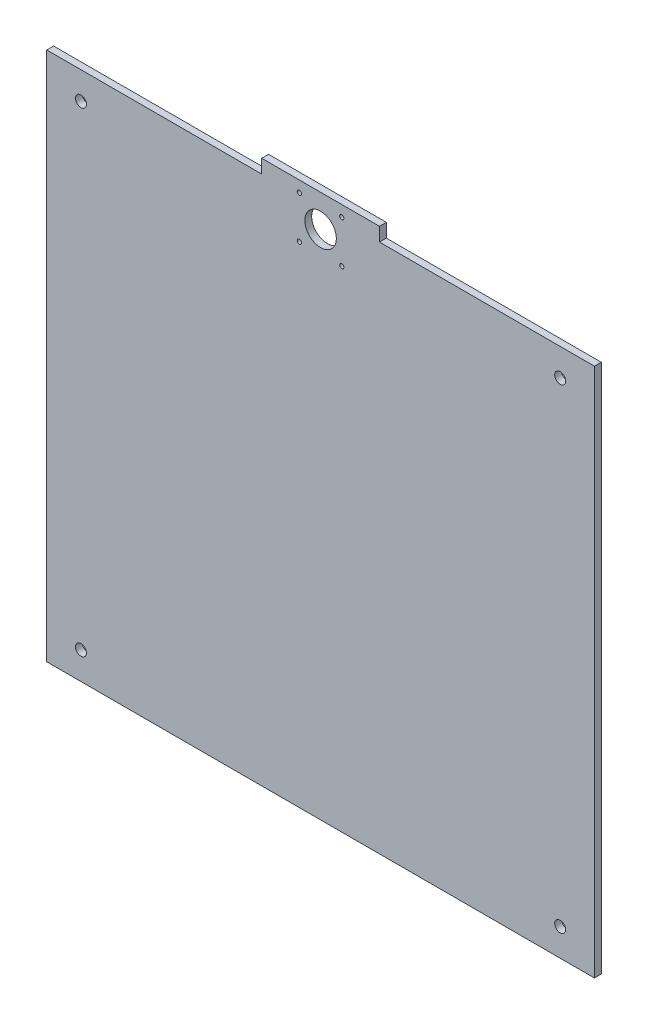
ISO-10303-21;
HEADER;
FILE_DESCRIPTION(('STEP AP214'),'2;1');
FILE_NAME('part.step','',(''),(''),'','','');
FILE_SCHEMA(('AUTOMOTIVE_DESIGN { 1 0 10303 214 1 1 1 1 }'));
ENDSEC;
DATA;
#1=APPLICATION_CONTEXT('core data for automotive mechanical design processes');
#2=APPLICATION_PROTOCOL_DEFINITION('international standard','automotive_design',2000,#1);
#3=PRODUCT_CONTEXT('',#1,'mechanical');
#4=PRODUCT('Part','Part','',(#3));
#5=PRODUCT_RELATED_PRODUCT_CATEGORY('part','',(#4));
#6=PRODUCT_DEFINITION_FORMATION('','',#4);
#7=PRODUCT_DEFINITION_CONTEXT('part definition',#1,'design');
#8=PRODUCT_DEFINITION('design','',#6,#7);
#9=PRODUCT_DEFINITION_SHAPE('','',#8);
#10=(LENGTH_UNIT() NAMED_UNIT(*) SI_UNIT(.MILLI.,.METRE.));
#11=(NAMED_UNIT(*) PLANE_ANGLE_UNIT() SI_UNIT($,.RADIAN.));
#12=(NAMED_UNIT(*) SI_UNIT($,.STERADIAN.) SOLID_ANGLE_UNIT());
#13=UNCERTAINTY_MEASURE_WITH_UNIT(LENGTH_MEASURE(1.E-05),#10,'distance_accuracy_value','');
#14=(GEOMETRIC_REPRESENTATION_CONTEXT(3) GLOBAL_UNCERTAINTY_ASSIGNED_CONTEXT((#13)) GLOBAL_UNIT_ASSIGNED_CONTEXT((#10,
#11,#12)) REPRESENTATION_CONTEXT('',''));
#15=CARTESIAN_POINT('',(0.,0.,0.));
#16=DIRECTION('',(0.,0.,1.));
#17=DIRECTION('',(1.,0.,0.));
#18=AXIS2_PLACEMENT_3D('',#15,#16,#17);
#19=CARTESIAN_POINT('',(0.,0.,5.));
#20=DIRECTION('',(1.,0.,0.));
#21=DIRECTION('',(0.,0.,-1.));
#22=AXIS2_PLACEMENT_3D('',#19,#20,#21);
#23=PLANE('',#22);
#24=DIRECTION('',(0.,-1.,0.));
#25=VECTOR('',#24,1.);
#26=CARTESIAN_POINT('',(0.,0.,5.));
#27=LINE('',#26,#25);
#28=CARTESIAN_POINT('',(0.,387.,5.));
#29=VERTEX_POINT('',#28);
#30=CARTESIAN_POINT('',(0.,0.,5.));
#31=VERTEX_POINT('',#30);
#32=EDGE_CURVE('E112',#29,#31,#27,.T.);
#33=ORIENTED_EDGE('',*,*,#32,.F.);
#34=DIRECTION('',(0.,0.,1.));
#35=VECTOR('',#34,1.);
#36=CARTESIAN_POINT('',(0.,387.,0.));
#37=LINE('',#36,#35);
#38=CARTESIAN_POINT('',(0.,387.,0.));
#39=VERTEX_POINT('',#38);
#40=EDGE_CURVE('E100',#39,#29,#37,.T.);
#41=ORIENTED_EDGE('',*,*,#40,.F.);
#42=DIRECTION('',(0.,-1.,0.));
#43=VECTOR('',#42,1.);
#44=CARTESIAN_POINT('',(0.,0.,0.));
#45=LINE('',#44,#43);
#46=CARTESIAN_POINT('',(0.,0.,0.));
#47=VERTEX_POINT('',#46);
#48=EDGE_CURVE('E110',#39,#47,#45,.T.);
#49=ORIENTED_EDGE('',*,*,#48,.T.);
#50=DIRECTION('',(0.,0.,-1.));
#51=VECTOR('',#50,1.);
#52=CARTESIAN_POINT('',(0.,0.,5.));
#53=LINE('',#52,#51);
#54=EDGE_CURVE('E11',#31,#47,#53,.T.);
#55=ORIENTED_EDGE('',*,*,#54,.F.);
#56=EDGE_LOOP('',(#33,#41,#49,#55));
#57=FACE_BOUND('',#56,.T.);
#58=ADVANCED_FACE('F33',(#57),#23,.F.);
#59=CARTESIAN_POINT('',(0.,0.,5.));
#60=DIRECTION('',(0.,1.,0.));
#61=DIRECTION('',(0.,0.,1.));
#62=AXIS2_PLACEMENT_3D('',#59,#60,#61);
#63=PLANE('',#62);
#64=DIRECTION('',(1.,0.,0.));
#65=VECTOR('',#64,1.);
#66=CARTESIAN_POINT('',(0.,0.,0.));
#67=LINE('',#66,#65);
#68=CARTESIAN_POINT('',(400.,0.,0.));
#69=VERTEX_POINT('',#68);
#70=EDGE_CURVE('E117',#47,#69,#67,.T.);
#71=ORIENTED_EDGE('',*,*,#70,.T.);
#72=DIRECTION('',(0.,0.,-1.));
#73=VECTOR('',#72,1.);
#74=CARTESIAN_POINT('',(400.,0.,5.));
#75=LINE('',#74,#73);
#76=CARTESIAN_POINT('',(400.,0.,5.));
#77=VERTEX_POINT('',#76);
#78=EDGE_CURVE('E40',#77,#69,#75,.T.);
#79=ORIENTED_EDGE('',*,*,#78,.F.);
#80=DIRECTION('',(1.,0.,0.));
#81=VECTOR('',#80,1.);
#82=CARTESIAN_POINT('',(0.,0.,5.));
#83=LINE('',#82,#81);
#84=EDGE_CURVE('E144',#31,#77,#83,.T.);
#85=ORIENTED_EDGE('',*,*,#84,.F.);
#86=ORIENTED_EDGE('',*,*,#54,.T.);
#87=EDGE_LOOP('',(#71,#79,#85,#86));
#88=FACE_BOUND('',#87,.T.);
#89=ADVANCED_FACE('F264',(#88),#63,.F.);
#90=CARTESIAN_POINT('',(400.,0.,5.));
#91=DIRECTION('',(-1.,0.,0.));
#92=DIRECTION('',(0.,0.,1.));
#93=AXIS2_PLACEMENT_3D('',#90,#91,#92);
#94=PLANE('',#93);
#95=DIRECTION('',(0.,1.,0.));
#96=VECTOR('',#95,1.);
#97=CARTESIAN_POINT('',(400.,0.,0.));
#98=LINE('',#97,#96);
#99=CARTESIAN_POINT('',(400.,387.,0.));
#100=VERTEX_POINT('',#99);
#101=EDGE_CURVE('E120',#69,#100,#98,.T.);
#102=ORIENTED_EDGE('',*,*,#101,.T.);
#103=DIRECTION('',(0.,0.,1.));
#104=VECTOR('',#103,1.);
#105=CARTESIAN_POINT('',(400.,387.,0.));
#106=LINE('',#105,#104);
#107=CARTESIAN_POINT('',(400.,387.,5.));
#108=VERTEX_POINT('',#107);
#109=EDGE_CURVE('E173',#100,#108,#106,.T.);
#110=ORIENTED_EDGE('',*,*,#109,.T.);
#111=DIRECTION('',(0.,1.,0.));
#112=VECTOR('',#111,1.);
#113=CARTESIAN_POINT('',(400.,0.,5.));
#114=LINE('',#113,#112);
#115=EDGE_CURVE('E138',#77,#108,#114,.T.);
#116=ORIENTED_EDGE('',*,*,#115,.F.);
#117=ORIENTED_EDGE('',*,*,#78,.T.);
#118=EDGE_LOOP('',(#102,#110,#116,#117));
#119=FACE_BOUND('',#118,.T.);
#120=ADVANCED_FACE('F268',(#119),#94,.F.);
#121=CARTESIAN_POINT('',(0.,397.,5.));
#122=DIRECTION('',(0.,-1.,0.));
#123=DIRECTION('',(0.,0.,-1.));
#124=AXIS2_PLACEMENT_3D('',#121,#122,#123);
#125=PLANE('',#124);
#126=DIRECTION('',(-1.,0.,0.));
#127=VECTOR('',#126,1.);
#128=CARTESIAN_POINT('',(0.,397.,0.));
#129=LINE('',#128,#127);
#130=CARTESIAN_POINT('',(243.,397.,0.));
#131=VERTEX_POINT('',#130);
#132=CARTESIAN_POINT('',(157.,397.,0.));
#133=VERTEX_POINT('',#132);
#134=EDGE_CURVE('E131',#131,#133,#129,.T.);
#135=ORIENTED_EDGE('',*,*,#134,.T.);
#136=DIRECTION('',(0.,0.,1.));
#137=VECTOR('',#136,1.);
#138=CARTESIAN_POINT('',(157.,397.,0.));
#139=LINE('',#138,#137);
#140=CARTESIAN_POINT('',(157.,397.,5.));
#141=VERTEX_POINT('',#140);
#142=EDGE_CURVE('E188',#133,#141,#139,.T.);
#143=ORIENTED_EDGE('',*,*,#142,.T.);
#144=DIRECTION('',(-1.,0.,0.));
#145=VECTOR('',#144,1.);
#146=CARTESIAN_POINT('',(0.,397.,5.));
#147=LINE('',#146,#145);
#148=CARTESIAN_POINT('',(243.,397.,5.));
#149=VERTEX_POINT('',#148);
#150=EDGE_CURVE('E126',#149,#141,#147,.T.);
#151=ORIENTED_EDGE('',*,*,#150,.F.);
#152=DIRECTION('',(0.,0.,1.));
#153=VECTOR('',#152,1.);
#154=CARTESIAN_POINT('',(243.,397.,0.));
#155=LINE('',#154,#153);
#156=EDGE_CURVE('E176',#131,#149,#155,.T.);
#157=ORIENTED_EDGE('',*,*,#156,.F.);
#158=EDGE_LOOP('',(#135,#143,#151,#157));
#159=FACE_BOUND('',#158,.T.);
#160=ADVANCED_FACE('F230',(#159),#125,.F.);
#161=CARTESIAN_POINT('',(0.,0.,5.));
#162=DIRECTION('',(0.,0.,-1.));
#163=DIRECTION('',(-1.,0.,0.));
#164=AXIS2_PLACEMENT_3D('',#161,#162,#163);
#165=PLANE('',#164);
#166=CARTESIAN_POINT('',(375.000000000002,367.03,5.));
#167=DIRECTION('',(0.,0.,1.));
#168=DIRECTION('',(-1.,0.,0.));
#169=AXIS2_PLACEMENT_3D('',#166,#167,#168);
#170=CIRCLE('',#169,3.99999999999999);
#171=CARTESIAN_POINT('',(371.000000000002,367.03,5.));
#172=VERTEX_POINT('',#171);
#173=EDGE_CURVE('E220',#172,#172,#170,.T.);
#174=ORIENTED_EDGE('',*,*,#173,.F.);
#175=EDGE_LOOP('',(#174));
#176=FACE_BOUND('',#175,.T.);
#177=CARTESIAN_POINT('',(375.000000000002,20.03,5.));
#178=DIRECTION('',(0.,0.,1.));
#179=DIRECTION('',(1.,0.,0.));
#180=AXIS2_PLACEMENT_3D('',#177,#178,#179);
#181=CIRCLE('',#180,4.00000000000005);
#182=CARTESIAN_POINT('',(379.000000000002,20.03,5.));
#183=VERTEX_POINT('',#182);
#184=EDGE_CURVE('E214',#183,#183,#181,.T.);
#185=ORIENTED_EDGE('',*,*,#184,.F.);
#186=EDGE_LOOP('',(#185));
#187=FACE_BOUND('',#186,.T.);
#188=CARTESIAN_POINT('',(24.9999999999984,20.03,5.));
#189=DIRECTION('',(0.,0.,1.));
#190=DIRECTION('',(-1.,0.,0.));
#191=AXIS2_PLACEMENT_3D('',#188,#189,#190);
#192=CIRCLE('',#191,4.);
#193=CARTESIAN_POINT('',(20.9999999999984,20.03,5.));
#194=VERTEX_POINT('',#193);
#195=EDGE_CURVE('E208',#194,#194,#192,.T.);
#196=ORIENTED_EDGE('',*,*,#195,.F.);
#197=EDGE_LOOP('',(#196));
#198=FACE_BOUND('',#197,.T.);
#199=CARTESIAN_POINT('',(24.9999999999984,367.03,5.));
#200=DIRECTION('',(0.,0.,1.));
#201=DIRECTION('',(1.,0.,0.));
#202=AXIS2_PLACEMENT_3D('',#199,#200,#201);
#203=CIRCLE('',#202,4.);
#204=CARTESIAN_POINT('',(28.9999999999984,367.03,5.));
#205=VERTEX_POINT('',#204);
#206=EDGE_CURVE('E202',#205,#205,#203,.T.);
#207=ORIENTED_EDGE('',*,*,#206,.F.);
#208=EDGE_LOOP('',(#207));
#209=FACE_BOUND('',#208,.T.);
#210=CARTESIAN_POINT('',(200.,373.5,5.));
#211=DIRECTION('',(0.,0.,1.));
#212=DIRECTION('',(1.,0.,0.));
#213=AXIS2_PLACEMENT_3D('',#210,#211,#212);
#214=CIRCLE('',#213,11.5);
#215=CARTESIAN_POINT('',(211.5,373.5,5.));
#216=VERTEX_POINT('',#215);
#217=EDGE_CURVE('E170',#216,#216,#214,.T.);
#218=ORIENTED_EDGE('',*,*,#217,.F.);
#219=EDGE_LOOP('',(#218));
#220=FACE_BOUND('',#219,.T.);
#221=CARTESIAN_POINT('',(184.5,389.,5.));
#222=DIRECTION('',(0.,0.,1.));
#223=DIRECTION('',(-1.,0.,0.));
#224=AXIS2_PLACEMENT_3D('',#221,#222,#223);
#225=CIRCLE('',#224,1.55);
#226=CARTESIAN_POINT('',(182.95,389.,5.));
#227=VERTEX_POINT('',#226);
#228=EDGE_CURVE('E164',#227,#227,#225,.T.);
#229=ORIENTED_EDGE('',*,*,#228,.F.);
#230=EDGE_LOOP('',(#229));
#231=FACE_BOUND('',#230,.T.);
#232=CARTESIAN_POINT('',(184.5,358.,5.));
#233=DIRECTION('',(0.,0.,1.));
#234=DIRECTION('',(-1.,0.,0.));
#235=AXIS2_PLACEMENT_3D('',#232,#233,#234);
#236=CIRCLE('',#235,1.55);
#237=CARTESIAN_POINT('',(182.95,358.,5.));
#238=VERTEX_POINT('',#237);
#239=EDGE_CURVE('E158',#238,#238,#236,.T.);
#240=ORIENTED_EDGE('',*,*,#239,.F.);
#241=EDGE_LOOP('',(#240));
#242=FACE_BOUND('',#241,.T.);
#243=CARTESIAN_POINT('',(215.5,358.,5.));
#244=DIRECTION('',(0.,0.,1.));
#245=DIRECTION('',(1.,0.,0.));
#246=AXIS2_PLACEMENT_3D('',#243,#244,#245);
#247=CIRCLE('',#246,1.55);
#248=CARTESIAN_POINT('',(217.05,358.,5.));
#249=VERTEX_POINT('',#248);
#250=EDGE_CURVE('E152',#249,#249,#247,.T.);
#251=ORIENTED_EDGE('',*,*,#250,.F.);
#252=EDGE_LOOP('',(#251));
#253=FACE_BOUND('',#252,.T.);
#254=CARTESIAN_POINT('',(215.5,389.,5.));
#255=DIRECTION('',(0.,0.,1.));
#256=DIRECTION('',(1.,0.,0.));
#257=AXIS2_PLACEMENT_3D('',#254,#255,#256);
#258=CIRCLE('',#257,1.55);
#259=CARTESIAN_POINT('',(217.05,389.,5.));
#260=VERTEX_POINT('',#259);
#261=EDGE_CURVE('E123',#260,#260,#258,.T.);
#262=ORIENTED_EDGE('',*,*,#261,.F.);
#263=EDGE_LOOP('',(#262));
#264=FACE_BOUND('',#263,.T.);
#265=ORIENTED_EDGE('',*,*,#150,.T.);
#266=DIRECTION('',(0.,1.,0.));
#267=VECTOR('',#266,1.);
#268=CARTESIAN_POINT('',(157.,387.,5.));
#269=LINE('',#268,#267);
#270=CARTESIAN_POINT('',(157.,387.,5.));
#271=VERTEX_POINT('',#270);
#272=EDGE_CURVE('E105',#271,#141,#269,.T.);
#273=ORIENTED_EDGE('',*,*,#272,.F.);
#274=DIRECTION('',(1.,0.,0.));
#275=VECTOR('',#274,1.);
#276=CARTESIAN_POINT('',(0.,387.,5.));
#277=LINE('',#276,#275);
#278=EDGE_CURVE('E196',#29,#271,#277,.T.);
#279=ORIENTED_EDGE('',*,*,#278,.F.);
#280=ORIENTED_EDGE('',*,*,#32,.T.);
#281=ORIENTED_EDGE('',*,*,#84,.T.);
#282=ORIENTED_EDGE('',*,*,#115,.T.);
#283=DIRECTION('',(1.,0.,0.));
#284=VECTOR('',#283,1.);
#285=CARTESIAN_POINT('',(400.,387.,5.));
#286=LINE('',#285,#284);
#287=CARTESIAN_POINT('',(243.,387.,5.));
#288=VERTEX_POINT('',#287);
#289=EDGE_CURVE('E182',#288,#108,#286,.T.);
#290=ORIENTED_EDGE('',*,*,#289,.F.);
#291=DIRECTION('',(0.,-1.,0.));
#292=VECTOR('',#291,1.);
#293=CARTESIAN_POINT('',(243.,387.,5.));
#294=LINE('',#293,#292);
#295=EDGE_CURVE('E185',#149,#288,#294,.T.);
#296=ORIENTED_EDGE('',*,*,#295,.F.);
#297=EDGE_LOOP('',(#265,#273,#279,#280,#281,#282,#290,#296));
#298=FACE_BOUND('',#297,.T.);
#299=ADVANCED_FACE('F227',(#176,#187,#198,#209,#220,#231,#242,#253,#264,#298),#165,.F.);
#300=CARTESIAN_POINT('',(0.,0.,0.));
#301=DIRECTION('',(0.,0.,-1.));
#302=DIRECTION('',(-1.,0.,0.));
#303=AXIS2_PLACEMENT_3D('',#300,#301,#302);
#304=PLANE('',#303);
#305=CARTESIAN_POINT('',(375.000000000002,367.03,0.));
#306=DIRECTION('',(0.,0.,-1.));
#307=DIRECTION('',(-1.,0.,0.));
#308=AXIS2_PLACEMENT_3D('',#305,#306,#307);
#309=CIRCLE('',#308,3.99999999999999);
#310=CARTESIAN_POINT('',(371.000000000002,367.03,0.));
#311=VERTEX_POINT('',#310);
#312=EDGE_CURVE('E217',#311,#311,#309,.F.);
#313=ORIENTED_EDGE('',*,*,#312,.T.);
#314=EDGE_LOOP('',(#313));
#315=FACE_BOUND('',#314,.T.);
#316=CARTESIAN_POINT('',(375.000000000002,20.03,0.));
#317=DIRECTION('',(0.,0.,-1.));
#318=DIRECTION('',(-1.,0.,0.));
#319=AXIS2_PLACEMENT_3D('',#316,#317,#318);
#320=CIRCLE('',#319,4.00000000000005);
#321=CARTESIAN_POINT('',(371.000000000002,20.03,0.));
#322=VERTEX_POINT('',#321);
#323=EDGE_CURVE('E211',#322,#322,#320,.F.);
#324=ORIENTED_EDGE('',*,*,#323,.T.);
#325=EDGE_LOOP('',(#324));
#326=FACE_BOUND('',#325,.T.);
#327=CARTESIAN_POINT('',(24.9999999999984,20.03,0.));
#328=DIRECTION('',(0.,0.,-1.));
#329=DIRECTION('',(-1.,0.,0.));
#330=AXIS2_PLACEMENT_3D('',#327,#328,#329);
#331=CIRCLE('',#330,4.);
#332=CARTESIAN_POINT('',(20.9999999999984,20.03,0.));
#333=VERTEX_POINT('',#332);
#334=EDGE_CURVE('E205',#333,#333,#331,.F.);
#335=ORIENTED_EDGE('',*,*,#334,.T.);
#336=EDGE_LOOP('',(#335));
#337=FACE_BOUND('',#336,.T.);
#338=CARTESIAN_POINT('',(24.9999999999984,367.03,0.));
#339=DIRECTION('',(0.,0.,-1.));
#340=DIRECTION('',(-1.,0.,0.));
#341=AXIS2_PLACEMENT_3D('',#338,#339,#340);
#342=CIRCLE('',#341,4.);
#343=CARTESIAN_POINT('',(20.9999999999984,367.03,0.));
#344=VERTEX_POINT('',#343);
#345=EDGE_CURVE('E198',#344,#344,#342,.F.);
#346=ORIENTED_EDGE('',*,*,#345,.T.);
#347=EDGE_LOOP('',(#346));
#348=FACE_BOUND('',#347,.T.);
#349=DIRECTION('',(0.,1.,0.));
#350=VECTOR('',#349,1.);
#351=CARTESIAN_POINT('',(157.,387.,0.));
#352=LINE('',#351,#350);
#353=CARTESIAN_POINT('',(157.,387.,0.));
#354=VERTEX_POINT('',#353);
#355=EDGE_CURVE('E47',#354,#133,#352,.T.);
#356=ORIENTED_EDGE('',*,*,#355,.T.);
#357=ORIENTED_EDGE('',*,*,#134,.F.);
#358=DIRECTION('',(0.,-1.,0.));
#359=VECTOR('',#358,1.);
#360=CARTESIAN_POINT('',(243.,387.,0.));
#361=LINE('',#360,#359);
#362=CARTESIAN_POINT('',(243.,387.,0.));
#363=VERTEX_POINT('',#362);
#364=EDGE_CURVE('E184',#131,#363,#361,.T.);
#365=ORIENTED_EDGE('',*,*,#364,.T.);
#366=DIRECTION('',(1.,0.,0.));
#367=VECTOR('',#366,1.);
#368=CARTESIAN_POINT('',(400.,387.,0.));
#369=LINE('',#368,#367);
#370=EDGE_CURVE('E55',#363,#100,#369,.T.);
#371=ORIENTED_EDGE('',*,*,#370,.T.);
#372=ORIENTED_EDGE('',*,*,#101,.F.);
#373=ORIENTED_EDGE('',*,*,#70,.F.);
#374=ORIENTED_EDGE('',*,*,#48,.F.);
#375=DIRECTION('',(1.,0.,0.));
#376=VECTOR('',#375,1.);
#377=CARTESIAN_POINT('',(0.,387.,0.));
#378=LINE('',#377,#376);
#379=EDGE_CURVE('E96',#39,#354,#378,.T.);
#380=ORIENTED_EDGE('',*,*,#379,.T.);
#381=EDGE_LOOP('',(#356,#357,#365,#371,#372,#373,#374,#380));
#382=FACE_BOUND('',#381,.T.);
#383=CARTESIAN_POINT('',(200.,373.5,0.));
#384=DIRECTION('',(0.,0.,1.));
#385=DIRECTION('',(1.,0.,0.));
#386=AXIS2_PLACEMENT_3D('',#383,#384,#385);
#387=CIRCLE('',#386,11.5);
#388=CARTESIAN_POINT('',(211.5,373.5,0.));
#389=VERTEX_POINT('',#388);
#390=EDGE_CURVE('E167',#389,#389,#387,.T.);
#391=ORIENTED_EDGE('',*,*,#390,.T.);
#392=EDGE_LOOP('',(#391));
#393=FACE_BOUND('',#392,.T.);
#394=CARTESIAN_POINT('',(184.5,389.,0.));
#395=DIRECTION('',(0.,0.,1.));
#396=DIRECTION('',(-1.,0.,0.));
#397=AXIS2_PLACEMENT_3D('',#394,#395,#396);
#398=CIRCLE('',#397,1.55);
#399=CARTESIAN_POINT('',(182.95,389.,0.));
#400=VERTEX_POINT('',#399);
#401=EDGE_CURVE('E161',#400,#400,#398,.T.);
#402=ORIENTED_EDGE('',*,*,#401,.T.);
#403=EDGE_LOOP('',(#402));
#404=FACE_BOUND('',#403,.T.);
#405=CARTESIAN_POINT('',(184.5,358.,0.));
#406=DIRECTION('',(0.,0.,1.));
#407=DIRECTION('',(-1.,0.,0.));
#408=AXIS2_PLACEMENT_3D('',#405,#406,#407);
#409=CIRCLE('',#408,1.55);
#410=CARTESIAN_POINT('',(182.95,358.,0.));
#411=VERTEX_POINT('',#410);
#412=EDGE_CURVE('E155',#411,#411,#409,.T.);
#413=ORIENTED_EDGE('',*,*,#412,.T.);
#414=EDGE_LOOP('',(#413));
#415=FACE_BOUND('',#414,.T.);
#416=CARTESIAN_POINT('',(215.5,358.,0.));
#417=DIRECTION('',(0.,0.,1.));
#418=DIRECTION('',(1.,0.,0.));
#419=AXIS2_PLACEMENT_3D('',#416,#417,#418);
#420=CIRCLE('',#419,1.55);
#421=CARTESIAN_POINT('',(217.05,358.,0.));
#422=VERTEX_POINT('',#421);
#423=EDGE_CURVE('E150',#422,#422,#420,.T.);
#424=ORIENTED_EDGE('',*,*,#423,.T.);
#425=EDGE_LOOP('',(#424));
#426=FACE_BOUND('',#425,.T.);
#427=CARTESIAN_POINT('',(215.5,389.,0.));
#428=DIRECTION('',(0.,0.,1.));
#429=DIRECTION('',(1.,0.,0.));
#430=AXIS2_PLACEMENT_3D('',#427,#428,#429);
#431=CIRCLE('',#430,1.55);
#432=CARTESIAN_POINT('',(217.05,389.,0.));
#433=VERTEX_POINT('',#432);
#434=EDGE_CURVE('E118',#433,#433,#431,.T.);
#435=ORIENTED_EDGE('',*,*,#434,.T.);
#436=EDGE_LOOP('',(#435));
#437=FACE_BOUND('',#436,.T.);
#438=ADVANCED_FACE('F114',(#315,#326,#337,#348,#382,#393,#404,#415,#426,#437),#304,.T.);
#439=CARTESIAN_POINT('',(215.5,389.,0.));
#440=DIRECTION('',(0.,0.,1.));
#441=DIRECTION('',(1.,0.,0.));
#442=AXIS2_PLACEMENT_3D('',#439,#440,#441);
#443=CYLINDRICAL_SURFACE('',#442,1.55);
#444=ORIENTED_EDGE('',*,*,#434,.F.);
#445=EDGE_LOOP('',(#444));
#446=FACE_BOUND('',#445,.T.);
#447=ORIENTED_EDGE('',*,*,#261,.T.);
#448=EDGE_LOOP('',(#447));
#449=FACE_BOUND('',#448,.T.);
#450=ADVANCED_FACE('F248',(#446,#449),#443,.F.);
#451=CARTESIAN_POINT('',(215.5,358.,0.));
#452=DIRECTION('',(0.,0.,1.));
#453=DIRECTION('',(1.,0.,0.));
#454=AXIS2_PLACEMENT_3D('',#451,#452,#453);
#455=CYLINDRICAL_SURFACE('',#454,1.55);
#456=ORIENTED_EDGE('',*,*,#423,.F.);
#457=EDGE_LOOP('',(#456));
#458=FACE_BOUND('',#457,.T.);
#459=ORIENTED_EDGE('',*,*,#250,.T.);
#460=EDGE_LOOP('',(#459));
#461=FACE_BOUND('',#460,.T.);
#462=ADVANCED_FACE('F250',(#458,#461),#455,.F.);
#463=CARTESIAN_POINT('',(184.5,358.,0.));
#464=DIRECTION('',(0.,0.,1.));
#465=DIRECTION('',(1.,0.,0.));
#466=AXIS2_PLACEMENT_3D('',#463,#464,#465);
#467=CYLINDRICAL_SURFACE('',#466,1.55);
#468=ORIENTED_EDGE('',*,*,#412,.F.);
#469=EDGE_LOOP('',(#468));
#470=FACE_BOUND('',#469,.T.);
#471=ORIENTED_EDGE('',*,*,#239,.T.);
#472=EDGE_LOOP('',(#471));
#473=FACE_BOUND('',#472,.T.);
#474=ADVANCED_FACE('F257',(#470,#473),#467,.F.);
#475=CARTESIAN_POINT('',(184.5,389.,0.));
#476=DIRECTION('',(0.,0.,1.));
#477=DIRECTION('',(1.,0.,0.));
#478=AXIS2_PLACEMENT_3D('',#475,#476,#477);
#479=CYLINDRICAL_SURFACE('',#478,1.55);
#480=ORIENTED_EDGE('',*,*,#401,.F.);
#481=EDGE_LOOP('',(#480));
#482=FACE_BOUND('',#481,.T.);
#483=ORIENTED_EDGE('',*,*,#228,.T.);
#484=EDGE_LOOP('',(#483));
#485=FACE_BOUND('',#484,.T.);
#486=ADVANCED_FACE('F293',(#482,#485),#479,.F.);
#487=CARTESIAN_POINT('',(200.,373.5,0.));
#488=DIRECTION('',(0.,0.,1.));
#489=DIRECTION('',(1.,0.,0.));
#490=AXIS2_PLACEMENT_3D('',#487,#488,#489);
#491=CYLINDRICAL_SURFACE('',#490,11.5);
#492=ORIENTED_EDGE('',*,*,#390,.F.);
#493=EDGE_LOOP('',(#492));
#494=FACE_BOUND('',#493,.T.);
#495=ORIENTED_EDGE('',*,*,#217,.T.);
#496=EDGE_LOOP('',(#495));
#497=FACE_BOUND('',#496,.T.);
#498=ADVANCED_FACE('F285',(#494,#497),#491,.F.);
#499=CARTESIAN_POINT('',(400.,387.,0.));
#500=DIRECTION('',(0.,-1.,0.));
#501=DIRECTION('',(1.,0.,0.));
#502=AXIS2_PLACEMENT_3D('',#499,#500,#501);
#503=PLANE('',#502);
#504=ORIENTED_EDGE('',*,*,#289,.T.);
#505=ORIENTED_EDGE('',*,*,#109,.F.);
#506=ORIENTED_EDGE('',*,*,#370,.F.);
#507=DIRECTION('',(0.,0.,1.));
#508=VECTOR('',#507,1.);
#509=CARTESIAN_POINT('',(243.,387.,0.));
#510=LINE('',#509,#508);
#511=EDGE_CURVE('E178',#363,#288,#510,.T.);
#512=ORIENTED_EDGE('',*,*,#511,.T.);
#513=EDGE_LOOP('',(#504,#505,#506,#512));
#514=FACE_BOUND('',#513,.T.);
#515=ADVANCED_FACE('F283',(#514),#503,.F.);
#516=CARTESIAN_POINT('',(243.,387.,0.));
#517=DIRECTION('',(-1.,0.,0.));
#518=DIRECTION('',(0.,0.,1.));
#519=AXIS2_PLACEMENT_3D('',#516,#517,#518);
#520=PLANE('',#519);
#521=ORIENTED_EDGE('',*,*,#295,.T.);
#522=ORIENTED_EDGE('',*,*,#511,.F.);
#523=ORIENTED_EDGE('',*,*,#364,.F.);
#524=ORIENTED_EDGE('',*,*,#156,.T.);
#525=EDGE_LOOP('',(#521,#522,#523,#524));
#526=FACE_BOUND('',#525,.T.);
#527=ADVANCED_FACE('F282',(#526),#520,.F.);
#528=CARTESIAN_POINT('',(157.,387.,0.));
#529=DIRECTION('',(1.,0.,0.));
#530=DIRECTION('',(0.,0.,-1.));
#531=AXIS2_PLACEMENT_3D('',#528,#529,#530);
#532=PLANE('',#531);
#533=ORIENTED_EDGE('',*,*,#272,.T.);
#534=ORIENTED_EDGE('',*,*,#142,.F.);
#535=ORIENTED_EDGE('',*,*,#355,.F.);
#536=DIRECTION('',(0.,0.,1.));
#537=VECTOR('',#536,1.);
#538=CARTESIAN_POINT('',(157.,387.,0.));
#539=LINE('',#538,#537);
#540=EDGE_CURVE('E102',#354,#271,#539,.T.);
#541=ORIENTED_EDGE('',*,*,#540,.T.);
#542=EDGE_LOOP('',(#533,#534,#535,#541));
#543=FACE_BOUND('',#542,.T.);
#544=ADVANCED_FACE('F291',(#543),#532,.F.);
#545=CARTESIAN_POINT('',(0.,387.,0.));
#546=DIRECTION('',(0.,-1.,0.));
#547=DIRECTION('',(0.,0.,-1.));
#548=AXIS2_PLACEMENT_3D('',#545,#546,#547);
#549=PLANE('',#548);
#550=ORIENTED_EDGE('',*,*,#278,.T.);
#551=ORIENTED_EDGE('',*,*,#540,.F.);
#552=ORIENTED_EDGE('',*,*,#379,.F.);
#553=ORIENTED_EDGE('',*,*,#40,.T.);
#554=EDGE_LOOP('',(#550,#551,#552,#553));
#555=FACE_BOUND('',#554,.T.);
#556=ADVANCED_FACE('F99',(#555),#549,.F.);
#557=CARTESIAN_POINT('',(24.9999999999984,367.03,-11.3137084989849));
#558=DIRECTION('',(0.,0.,1.));
#559=DIRECTION('',(1.,0.,0.));
#560=AXIS2_PLACEMENT_3D('',#557,#558,#559);
#561=CYLINDRICAL_SURFACE('',#560,4.);
#562=ORIENTED_EDGE('',*,*,#206,.T.);
#563=EDGE_LOOP('',(#562));
#564=FACE_BOUND('',#563,.T.);
#565=ORIENTED_EDGE('',*,*,#345,.F.);
#566=EDGE_LOOP('',(#565));
#567=FACE_BOUND('',#566,.T.);
#568=ADVANCED_FACE('F365',(#564,#567),#561,.F.);
#569=CARTESIAN_POINT('',(24.9999999999984,20.03,-11.3137084989849));
#570=DIRECTION('',(0.,0.,1.));
#571=DIRECTION('',(1.,0.,0.));
#572=AXIS2_PLACEMENT_3D('',#569,#570,#571);
#573=CYLINDRICAL_SURFACE('',#572,4.);
#574=ORIENTED_EDGE('',*,*,#195,.T.);
#575=EDGE_LOOP('',(#574));
#576=FACE_BOUND('',#575,.T.);
#577=ORIENTED_EDGE('',*,*,#334,.F.);
#578=EDGE_LOOP('',(#577));
#579=FACE_BOUND('',#578,.T.);
#580=ADVANCED_FACE('F385',(#576,#579),#573,.F.);
#581=CARTESIAN_POINT('',(375.000000000002,20.03,-11.3137084989849));
#582=DIRECTION('',(0.,0.,1.));
#583=DIRECTION('',(1.,0.,0.));
#584=AXIS2_PLACEMENT_3D('',#581,#582,#583);
#585=CYLINDRICAL_SURFACE('',#584,4.00000000000005);
#586=ORIENTED_EDGE('',*,*,#184,.T.);
#587=EDGE_LOOP('',(#586));
#588=FACE_BOUND('',#587,.T.);
#589=ORIENTED_EDGE('',*,*,#323,.F.);
#590=EDGE_LOOP('',(#589));
#591=FACE_BOUND('',#590,.T.);
#592=ADVANCED_FACE('F395',(#588,#591),#585,.F.);
#593=CARTESIAN_POINT('',(375.000000000002,367.03,-11.3137084989849));
#594=DIRECTION('',(0.,0.,1.));
#595=DIRECTION('',(1.,0.,0.));
#596=AXIS2_PLACEMENT_3D('',#593,#594,#595);
#597=CYLINDRICAL_SURFACE('',#596,3.99999999999999);
#598=ORIENTED_EDGE('',*,*,#173,.T.);
#599=EDGE_LOOP('',(#598));
#600=FACE_BOUND('',#599,.T.);
#601=ORIENTED_EDGE('',*,*,#312,.F.);
#602=EDGE_LOOP('',(#601));
#603=FACE_BOUND('',#602,.T.);
#604=ADVANCED_FACE('F224',(#600,#603),#597,.F.);
#605=CLOSED_SHELL('',(#58,#89,#120,#160,#299,#438,#450,#462,#474,#486,#498,#515,#527,#544,#556,
#568,#580,#592,#604));
#606=MANIFOLD_SOLID_BREP('B2',#605);
#607=ADVANCED_BREP_SHAPE_REPRESENTATION('',(#18,#606),#14);
#608=SHAPE_DEFINITION_REPRESENTATION(#9,#607);
ENDSEC;
END-ISO-10303-21;
